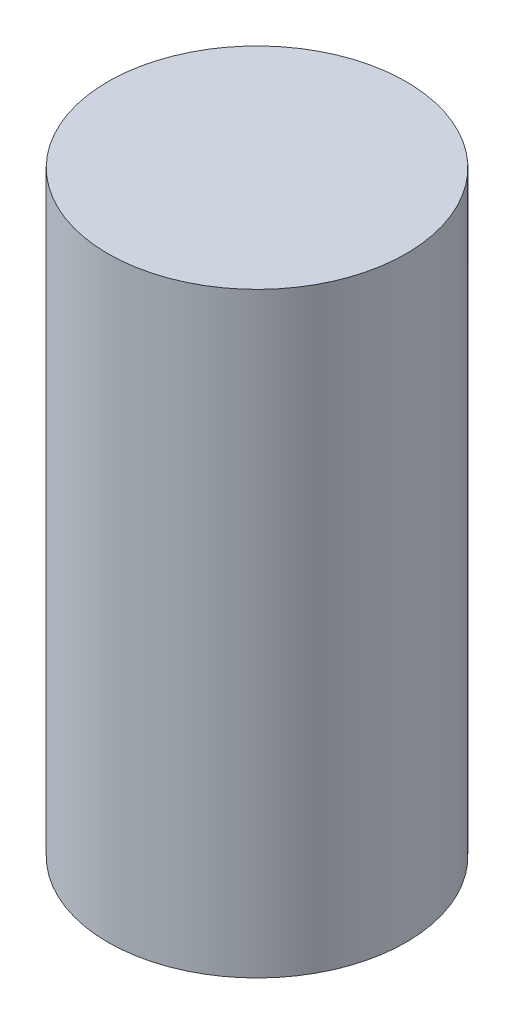
ISO-10303-21;
HEADER;
FILE_DESCRIPTION(('STEP AP214'),'2;1');
FILE_NAME('part.step','',(''),(''),'','','');
FILE_SCHEMA(('AUTOMOTIVE_DESIGN { 1 0 10303 214 1 1 1 1 }'));
ENDSEC;
DATA;
#1=APPLICATION_CONTEXT('core data for automotive mechanical design processes');
#2=APPLICATION_PROTOCOL_DEFINITION('international standard','automotive_design',2000,#1);
#3=PRODUCT_CONTEXT('',#1,'mechanical');
#4=PRODUCT('Part','Part','',(#3));
#5=PRODUCT_RELATED_PRODUCT_CATEGORY('part','',(#4));
#6=PRODUCT_DEFINITION_FORMATION('','',#4);
#7=PRODUCT_DEFINITION_CONTEXT('part definition',#1,'design');
#8=PRODUCT_DEFINITION('design','',#6,#7);
#9=PRODUCT_DEFINITION_SHAPE('','',#8);
#10=(LENGTH_UNIT() NAMED_UNIT(*) SI_UNIT(.MILLI.,.METRE.));
#11=(NAMED_UNIT(*) PLANE_ANGLE_UNIT() SI_UNIT($,.RADIAN.));
#12=(NAMED_UNIT(*) SI_UNIT($,.STERADIAN.) SOLID_ANGLE_UNIT());
#13=UNCERTAINTY_MEASURE_WITH_UNIT(LENGTH_MEASURE(1.E-05),#10,'distance_accuracy_value','');
#14=(GEOMETRIC_REPRESENTATION_CONTEXT(3) GLOBAL_UNCERTAINTY_ASSIGNED_CONTEXT((#13)) GLOBAL_UNIT_ASSIGNED_CONTEXT((#10,
#11,#12)) REPRESENTATION_CONTEXT('',''));
#15=CARTESIAN_POINT('',(0.,0.,0.));
#16=DIRECTION('',(0.,0.,1.));
#17=DIRECTION('',(1.,0.,0.));
#18=AXIS2_PLACEMENT_3D('',#15,#16,#17);
#19=CARTESIAN_POINT('',(0.,38.1,0.));
#20=DIRECTION('',(0.,-1.,0.));
#21=DIRECTION('',(0.,0.,-1.));
#22=AXIS2_PLACEMENT_3D('',#19,#20,#21);
#23=CYLINDRICAL_SURFACE('',#22,9.525);
#24=CARTESIAN_POINT('',(0.,38.1,0.));
#25=DIRECTION('',(0.,1.,0.));
#26=DIRECTION('',(0.,0.,1.));
#27=AXIS2_PLACEMENT_3D('',#24,#25,#26);
#28=CIRCLE('',#27,9.525);
#29=CARTESIAN_POINT('',(0.,38.1,9.525));
#30=VERTEX_POINT('',#29);
#31=EDGE_CURVE('E10',#30,#30,#28,.T.);
#32=ORIENTED_EDGE('',*,*,#31,.F.);
#33=EDGE_LOOP('',(#32));
#34=FACE_BOUND('',#33,.T.);
#35=CARTESIAN_POINT('',(0.,0.,0.));
#36=DIRECTION('',(0.,1.,0.));
#37=DIRECTION('',(0.,0.,1.));
#38=AXIS2_PLACEMENT_3D('',#35,#36,#37);
#39=CIRCLE('',#38,9.525);
#40=CARTESIAN_POINT('',(0.,0.,9.525));
#41=VERTEX_POINT('',#40);
#42=EDGE_CURVE('E35',#41,#41,#39,.T.);
#43=ORIENTED_EDGE('',*,*,#42,.T.);
#44=EDGE_LOOP('',(#43));
#45=FACE_BOUND('',#44,.T.);
#46=ADVANCED_FACE('F32',(#34,#45),#23,.T.);
#47=CARTESIAN_POINT('',(0.,38.1,0.));
#48=DIRECTION('',(0.,1.,0.));
#49=DIRECTION('',(0.,0.,1.));
#50=AXIS2_PLACEMENT_3D('',#47,#48,#49);
#51=PLANE('',#50);
#52=ORIENTED_EDGE('',*,*,#31,.T.);
#53=EDGE_LOOP('',(#52));
#54=FACE_BOUND('',#53,.T.);
#55=ADVANCED_FACE('F47',(#54),#51,.T.);
#56=CARTESIAN_POINT('',(0.,0.,0.));
#57=DIRECTION('',(0.,1.,0.));
#58=DIRECTION('',(0.,0.,1.));
#59=AXIS2_PLACEMENT_3D('',#56,#57,#58);
#60=PLANE('',#59);
#61=ORIENTED_EDGE('',*,*,#42,.F.);
#62=EDGE_LOOP('',(#61));
#63=FACE_BOUND('',#62,.T.);
#64=ADVANCED_FACE('F45',(#63),#60,.F.);
#65=CLOSED_SHELL('',(#46,#55,#64));
#66=MANIFOLD_SOLID_BREP('B2',#65);
#67=ADVANCED_BREP_SHAPE_REPRESENTATION('',(#18,#66),#14);
#68=SHAPE_DEFINITION_REPRESENTATION(#9,#67);
ENDSEC;
END-ISO-10303-21;
